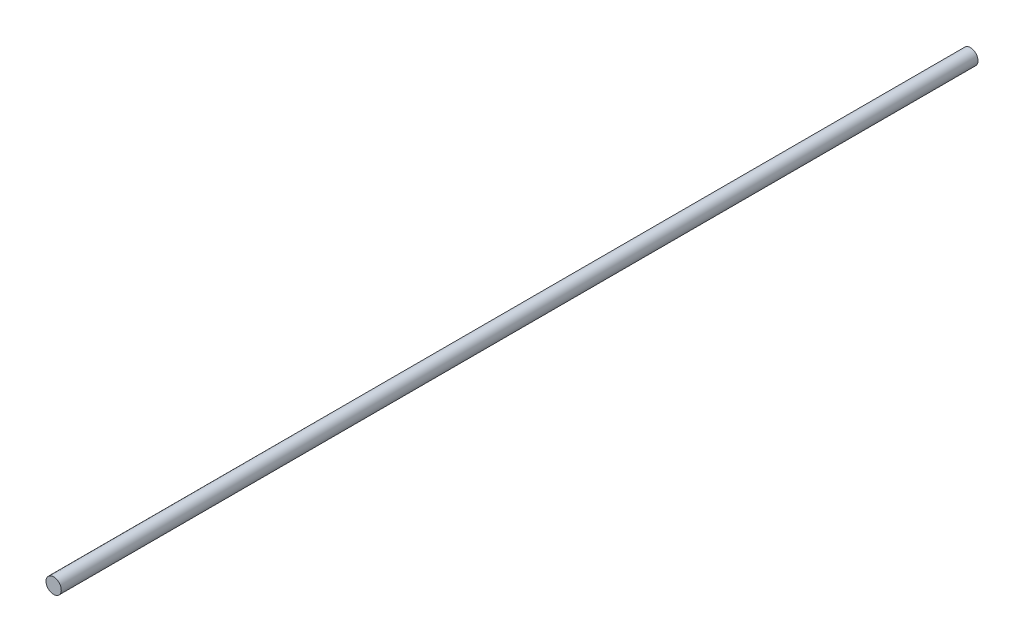
ISO-10303-21;
HEADER;
FILE_DESCRIPTION(('STEP AP214'),'2;1');
FILE_NAME('part.step','',(''),(''),'','','');
FILE_SCHEMA(('AUTOMOTIVE_DESIGN { 1 0 10303 214 1 1 1 1 }'));
ENDSEC;
DATA;
#1=APPLICATION_CONTEXT('core data for automotive mechanical design processes');
#2=APPLICATION_PROTOCOL_DEFINITION('international standard','automotive_design',2000,#1);
#3=PRODUCT_CONTEXT('',#1,'mechanical');
#4=PRODUCT('Part','Part','',(#3));
#5=PRODUCT_RELATED_PRODUCT_CATEGORY('part','',(#4));
#6=PRODUCT_DEFINITION_FORMATION('','',#4);
#7=PRODUCT_DEFINITION_CONTEXT('part definition',#1,'design');
#8=PRODUCT_DEFINITION('design','',#6,#7);
#9=PRODUCT_DEFINITION_SHAPE('','',#8);
#10=(LENGTH_UNIT() NAMED_UNIT(*) SI_UNIT(.MILLI.,.METRE.));
#11=(NAMED_UNIT(*) PLANE_ANGLE_UNIT() SI_UNIT($,.RADIAN.));
#12=(NAMED_UNIT(*) SI_UNIT($,.STERADIAN.) SOLID_ANGLE_UNIT());
#13=UNCERTAINTY_MEASURE_WITH_UNIT(LENGTH_MEASURE(1.E-05),#10,'distance_accuracy_value','');
#14=(GEOMETRIC_REPRESENTATION_CONTEXT(3) GLOBAL_UNCERTAINTY_ASSIGNED_CONTEXT((#13)) GLOBAL_UNIT_ASSIGNED_CONTEXT((#10,
#11,#12)) REPRESENTATION_CONTEXT('',''));
#15=CARTESIAN_POINT('',(0.,0.,0.));
#16=DIRECTION('',(0.,0.,1.));
#17=DIRECTION('',(1.,0.,0.));
#18=AXIS2_PLACEMENT_3D('',#15,#16,#17);
#19=CARTESIAN_POINT('',(0.,0.,300.));
#20=DIRECTION('',(0.,0.,-1.));
#21=DIRECTION('',(-1.,0.,0.));
#22=AXIS2_PLACEMENT_3D('',#19,#20,#21);
#23=CYLINDRICAL_SURFACE('',#22,5.);
#24=CARTESIAN_POINT('',(0.,0.,300.));
#25=DIRECTION('',(0.,0.,1.));
#26=DIRECTION('',(1.,0.,0.));
#27=AXIS2_PLACEMENT_3D('',#24,#25,#26);
#28=CIRCLE('',#27,5.);
#29=CARTESIAN_POINT('',(5.,0.,300.));
#30=VERTEX_POINT('',#29);
#31=EDGE_CURVE('E10',#30,#30,#28,.T.);
#32=ORIENTED_EDGE('',*,*,#31,.F.);
#33=EDGE_LOOP('',(#32));
#34=FACE_BOUND('',#33,.T.);
#35=CARTESIAN_POINT('',(0.,0.,-300.));
#36=DIRECTION('',(0.,0.,1.));
#37=DIRECTION('',(1.,0.,0.));
#38=AXIS2_PLACEMENT_3D('',#35,#36,#37);
#39=CIRCLE('',#38,5.);
#40=CARTESIAN_POINT('',(5.,0.,-300.));
#41=VERTEX_POINT('',#40);
#42=EDGE_CURVE('E34',#41,#41,#39,.T.);
#43=ORIENTED_EDGE('',*,*,#42,.T.);
#44=EDGE_LOOP('',(#43));
#45=FACE_BOUND('',#44,.T.);
#46=ADVANCED_FACE('F31',(#34,#45),#23,.T.);
#47=CARTESIAN_POINT('',(0.,0.,300.));
#48=DIRECTION('',(0.,0.,1.));
#49=DIRECTION('',(1.,0.,0.));
#50=AXIS2_PLACEMENT_3D('',#47,#48,#49);
#51=PLANE('',#50);
#52=ORIENTED_EDGE('',*,*,#31,.T.);
#53=EDGE_LOOP('',(#52));
#54=FACE_BOUND('',#53,.T.);
#55=ADVANCED_FACE('F46',(#54),#51,.T.);
#56=CARTESIAN_POINT('',(0.,0.,-300.));
#57=DIRECTION('',(0.,0.,1.));
#58=DIRECTION('',(1.,0.,0.));
#59=AXIS2_PLACEMENT_3D('',#56,#57,#58);
#60=PLANE('',#59);
#61=ORIENTED_EDGE('',*,*,#42,.F.);
#62=EDGE_LOOP('',(#61));
#63=FACE_BOUND('',#62,.T.);
#64=ADVANCED_FACE('F44',(#63),#60,.F.);
#65=CLOSED_SHELL('',(#46,#55,#64));
#66=MANIFOLD_SOLID_BREP('B2',#65);
#67=ADVANCED_BREP_SHAPE_REPRESENTATION('',(#18,#66),#14);
#68=SHAPE_DEFINITION_REPRESENTATION(#9,#67);
ENDSEC;
END-ISO-10303-21;
